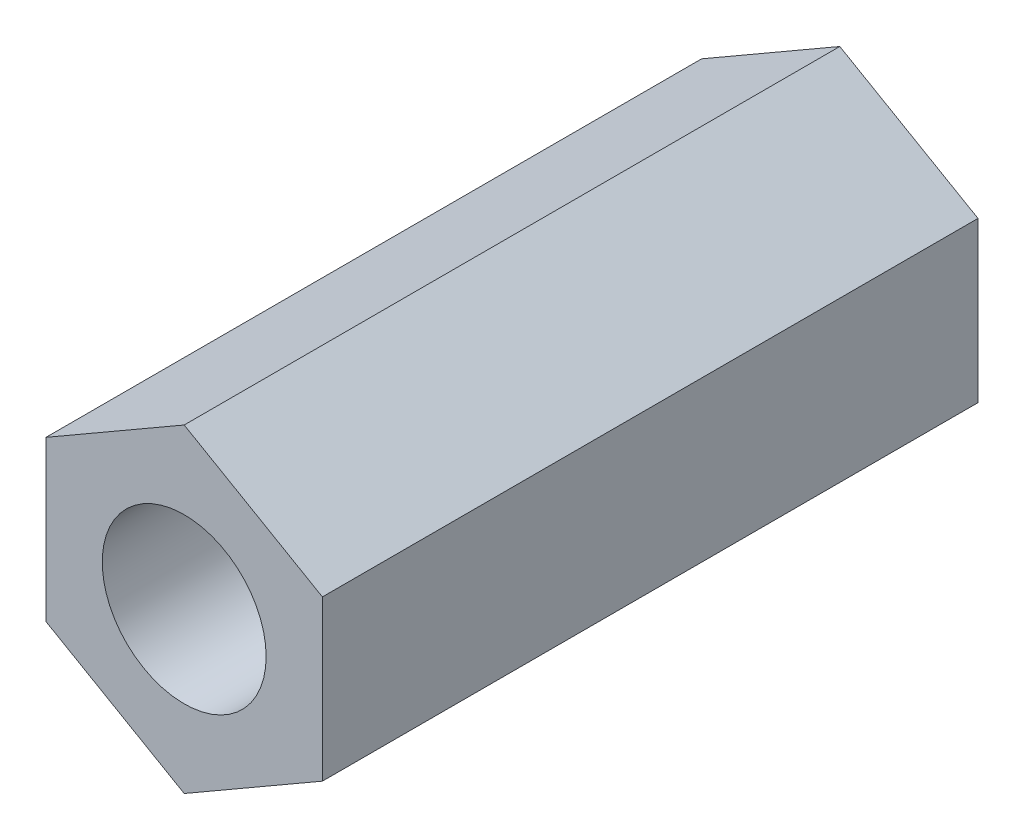
ISO-10303-21;
HEADER;
FILE_DESCRIPTION(('STEP AP214'),'2;1');
FILE_NAME('part.step','',(''),(''),'','','');
FILE_SCHEMA(('AUTOMOTIVE_DESIGN { 1 0 10303 214 1 1 1 1 }'));
ENDSEC;
DATA;
#1=APPLICATION_CONTEXT('core data for automotive mechanical design processes');
#2=APPLICATION_PROTOCOL_DEFINITION('international standard','automotive_design',2000,#1);
#3=PRODUCT_CONTEXT('',#1,'mechanical');
#4=PRODUCT('Part','Part','',(#3));
#5=PRODUCT_RELATED_PRODUCT_CATEGORY('part','',(#4));
#6=PRODUCT_DEFINITION_FORMATION('','',#4);
#7=PRODUCT_DEFINITION_CONTEXT('part definition',#1,'design');
#8=PRODUCT_DEFINITION('design','',#6,#7);
#9=PRODUCT_DEFINITION_SHAPE('','',#8);
#10=(LENGTH_UNIT() NAMED_UNIT(*) SI_UNIT(.MILLI.,.METRE.));
#11=(NAMED_UNIT(*) PLANE_ANGLE_UNIT() SI_UNIT($,.RADIAN.));
#12=(NAMED_UNIT(*) SI_UNIT($,.STERADIAN.) SOLID_ANGLE_UNIT());
#13=UNCERTAINTY_MEASURE_WITH_UNIT(LENGTH_MEASURE(1.E-05),#10,'distance_accuracy_value','');
#14=(GEOMETRIC_REPRESENTATION_CONTEXT(3) GLOBAL_UNCERTAINTY_ASSIGNED_CONTEXT((#13)) GLOBAL_UNIT_ASSIGNED_CONTEXT((#10,
#11,#12)) REPRESENTATION_CONTEXT('',''));
#15=CARTESIAN_POINT('',(0.,0.,0.));
#16=DIRECTION('',(0.,0.,1.));
#17=DIRECTION('',(1.,0.,0.));
#18=AXIS2_PLACEMENT_3D('',#15,#16,#17);
#19=CARTESIAN_POINT('',(0.,0.,11.176));
#20=DIRECTION('',(0.,0.,1.));
#21=DIRECTION('',(1.,0.,0.));
#22=AXIS2_PLACEMENT_3D('',#19,#20,#21);
#23=PLANE('',#22);
#24=DIRECTION('',(0.866025403784439,-0.499999999999999,0.));
#25=VECTOR('',#24,1.);
#26=CARTESIAN_POINT('',(-65.1574142062362,34.8983493683296,11.176));
#27=LINE('',#26,#25);
#28=CARTESIAN_POINT('',(-65.1574142062362,34.8983493683296,11.176));
#29=VERTEX_POINT('',#28);
#30=CARTESIAN_POINT('',(-62.8015642062362,33.5381987366592,11.176));
#31=VERTEX_POINT('',#30);
#32=EDGE_CURVE('E129',#29,#31,#27,.T.);
#33=ORIENTED_EDGE('',*,*,#32,.T.);
#34=DIRECTION('',(0.866025403784438,0.500000000000001,0.));
#35=VECTOR('',#34,1.);
#36=CARTESIAN_POINT('',(-62.8015642062362,33.5381987366592,11.176));
#37=LINE('',#36,#35);
#38=CARTESIAN_POINT('',(-60.4457142062362,34.8983493683296,11.176));
#39=VERTEX_POINT('',#38);
#40=EDGE_CURVE('E87',#31,#39,#37,.T.);
#41=ORIENTED_EDGE('',*,*,#40,.T.);
#42=DIRECTION('',(0.,1.,0.));
#43=VECTOR('',#42,1.);
#44=CARTESIAN_POINT('',(-60.4457142062362,34.8983493683296,11.176));
#45=LINE('',#44,#43);
#46=CARTESIAN_POINT('',(-60.4457142062362,37.6186506316703,11.176));
#47=VERTEX_POINT('',#46);
#48=EDGE_CURVE('E100',#39,#47,#45,.T.);
#49=ORIENTED_EDGE('',*,*,#48,.T.);
#50=DIRECTION('',(-0.866025403784439,0.499999999999999,0.));
#51=VECTOR('',#50,1.);
#52=CARTESIAN_POINT('',(-60.4457142062362,37.6186506316703,11.176));
#53=LINE('',#52,#51);
#54=CARTESIAN_POINT('',(-62.8015642062362,38.9788012633407,11.176));
#55=VERTEX_POINT('',#54);
#56=EDGE_CURVE('E94',#47,#55,#53,.T.);
#57=ORIENTED_EDGE('',*,*,#56,.T.);
#58=DIRECTION('',(-0.866025403784439,-0.499999999999999,0.));
#59=VECTOR('',#58,1.);
#60=CARTESIAN_POINT('',(-62.8015642062362,38.9788012633407,11.176));
#61=LINE('',#60,#59);
#62=CARTESIAN_POINT('',(-65.1574142062362,37.6186506316703,11.176));
#63=VERTEX_POINT('',#62);
#64=EDGE_CURVE('E98',#55,#63,#61,.T.);
#65=ORIENTED_EDGE('',*,*,#64,.T.);
#66=DIRECTION('',(0.,-1.,0.));
#67=VECTOR('',#66,1.);
#68=CARTESIAN_POINT('',(-65.1574142062362,37.6186506316703,11.176));
#69=LINE('',#68,#67);
#70=EDGE_CURVE('E50',#63,#29,#69,.T.);
#71=ORIENTED_EDGE('',*,*,#70,.T.);
#72=EDGE_LOOP('',(#33,#41,#49,#57,#65,#71));
#73=FACE_BOUND('',#72,.T.);
#74=CARTESIAN_POINT('',(-62.8015642062362,36.2584999999999,11.176));
#75=DIRECTION('',(0.,0.,1.));
#76=DIRECTION('',(1.,0.,0.));
#77=AXIS2_PLACEMENT_3D('',#74,#75,#76);
#78=CIRCLE('',#77,1.39700000000001);
#79=CARTESIAN_POINT('',(-61.4045642062362,36.2584999999999,11.176));
#80=VERTEX_POINT('',#79);
#81=EDGE_CURVE('E122',#80,#80,#78,.T.);
#82=ORIENTED_EDGE('',*,*,#81,.F.);
#83=EDGE_LOOP('',(#82));
#84=FACE_BOUND('',#83,.T.);
#85=ADVANCED_FACE('F33',(#73,#84),#23,.T.);
#86=CARTESIAN_POINT('',(0.,0.,0.));
#87=DIRECTION('',(0.,0.,1.));
#88=DIRECTION('',(1.,0.,0.));
#89=AXIS2_PLACEMENT_3D('',#86,#87,#88);
#90=PLANE('',#89);
#91=DIRECTION('',(0.866025403784439,-0.499999999999999,0.));
#92=VECTOR('',#91,1.);
#93=CARTESIAN_POINT('',(-65.1574142062362,34.8983493683296,0.));
#94=LINE('',#93,#92);
#95=CARTESIAN_POINT('',(-65.1574142062362,34.8983493683296,0.));
#96=VERTEX_POINT('',#95);
#97=CARTESIAN_POINT('',(-62.8015642062362,33.5381987366592,0.));
#98=VERTEX_POINT('',#97);
#99=EDGE_CURVE('E118',#96,#98,#94,.T.);
#100=ORIENTED_EDGE('',*,*,#99,.F.);
#101=DIRECTION('',(0.,-1.,0.));
#102=VECTOR('',#101,1.);
#103=CARTESIAN_POINT('',(-65.1574142062362,37.6186506316703,0.));
#104=LINE('',#103,#102);
#105=CARTESIAN_POINT('',(-65.1574142062362,37.6186506316703,0.));
#106=VERTEX_POINT('',#105);
#107=EDGE_CURVE('E79',#106,#96,#104,.T.);
#108=ORIENTED_EDGE('',*,*,#107,.F.);
#109=DIRECTION('',(-0.866025403784439,-0.499999999999999,0.));
#110=VECTOR('',#109,1.);
#111=CARTESIAN_POINT('',(-62.8015642062362,38.9788012633407,0.));
#112=LINE('',#111,#110);
#113=CARTESIAN_POINT('',(-62.8015642062362,38.9788012633407,0.));
#114=VERTEX_POINT('',#113);
#115=EDGE_CURVE('E73',#114,#106,#112,.T.);
#116=ORIENTED_EDGE('',*,*,#115,.F.);
#117=DIRECTION('',(-0.866025403784439,0.499999999999999,0.));
#118=VECTOR('',#117,1.);
#119=CARTESIAN_POINT('',(-60.4457142062362,37.6186506316703,0.));
#120=LINE('',#119,#118);
#121=CARTESIAN_POINT('',(-60.4457142062362,37.6186506316703,0.));
#122=VERTEX_POINT('',#121);
#123=EDGE_CURVE('E108',#122,#114,#120,.T.);
#124=ORIENTED_EDGE('',*,*,#123,.F.);
#125=DIRECTION('',(0.,1.,0.));
#126=VECTOR('',#125,1.);
#127=CARTESIAN_POINT('',(-60.4457142062362,34.8983493683296,0.));
#128=LINE('',#127,#126);
#129=CARTESIAN_POINT('',(-60.4457142062362,34.8983493683296,0.));
#130=VERTEX_POINT('',#129);
#131=EDGE_CURVE('E124',#130,#122,#128,.T.);
#132=ORIENTED_EDGE('',*,*,#131,.F.);
#133=DIRECTION('',(0.866025403784438,0.500000000000001,0.));
#134=VECTOR('',#133,1.);
#135=CARTESIAN_POINT('',(-62.8015642062362,33.5381987366592,0.));
#136=LINE('',#135,#134);
#137=EDGE_CURVE('E121',#98,#130,#136,.T.);
#138=ORIENTED_EDGE('',*,*,#137,.F.);
#139=EDGE_LOOP('',(#100,#108,#116,#124,#132,#138));
#140=FACE_BOUND('',#139,.T.);
#141=CARTESIAN_POINT('',(-62.8015642062362,36.2584999999999,0.));
#142=DIRECTION('',(0.,0.,1.));
#143=DIRECTION('',(1.,0.,0.));
#144=AXIS2_PLACEMENT_3D('',#141,#142,#143);
#145=CIRCLE('',#144,1.39700000000001);
#146=CARTESIAN_POINT('',(-61.4045642062362,36.2584999999999,0.));
#147=VERTEX_POINT('',#146);
#148=EDGE_CURVE('E222',#147,#147,#145,.T.);
#149=ORIENTED_EDGE('',*,*,#148,.T.);
#150=EDGE_LOOP('',(#149));
#151=FACE_BOUND('',#150,.T.);
#152=ADVANCED_FACE('F138',(#140,#151),#90,.F.);
#153=CARTESIAN_POINT('',(-65.1574142062362,34.8983493683296,11.176));
#154=DIRECTION('',(0.499999999999999,0.866025403784439,0.));
#155=DIRECTION('',(-0.866025403784439,0.499999999999999,0.));
#156=AXIS2_PLACEMENT_3D('',#153,#154,#155);
#157=PLANE('',#156);
#158=ORIENTED_EDGE('',*,*,#99,.T.);
#159=DIRECTION('',(0.,0.,-1.));
#160=VECTOR('',#159,1.);
#161=CARTESIAN_POINT('',(-62.8015642062362,33.5381987366592,11.176));
#162=LINE('',#161,#160);
#163=EDGE_CURVE('E11',#31,#98,#162,.T.);
#164=ORIENTED_EDGE('',*,*,#163,.F.);
#165=ORIENTED_EDGE('',*,*,#32,.F.);
#166=DIRECTION('',(0.,0.,-1.));
#167=VECTOR('',#166,1.);
#168=CARTESIAN_POINT('',(-65.1574142062362,34.8983493683296,11.176));
#169=LINE('',#168,#167);
#170=EDGE_CURVE('E114',#29,#96,#169,.T.);
#171=ORIENTED_EDGE('',*,*,#170,.T.);
#172=EDGE_LOOP('',(#158,#164,#165,#171));
#173=FACE_BOUND('',#172,.T.);
#174=ADVANCED_FACE('F35',(#173),#157,.F.);
#175=CARTESIAN_POINT('',(-62.8015642062362,33.5381987366592,11.176));
#176=DIRECTION('',(-0.500000000000001,0.866025403784438,0.));
#177=DIRECTION('',(-0.866025403784438,-0.500000000000001,0.));
#178=AXIS2_PLACEMENT_3D('',#175,#176,#177);
#179=PLANE('',#178);
#180=ORIENTED_EDGE('',*,*,#137,.T.);
#181=DIRECTION('',(0.,0.,-1.));
#182=VECTOR('',#181,1.);
#183=CARTESIAN_POINT('',(-60.4457142062362,34.8983493683296,11.176));
#184=LINE('',#183,#182);
#185=EDGE_CURVE('E42',#39,#130,#184,.T.);
#186=ORIENTED_EDGE('',*,*,#185,.F.);
#187=ORIENTED_EDGE('',*,*,#40,.F.);
#188=ORIENTED_EDGE('',*,*,#163,.T.);
#189=EDGE_LOOP('',(#180,#186,#187,#188));
#190=FACE_BOUND('',#189,.T.);
#191=ADVANCED_FACE('F163',(#190),#179,.F.);
#192=CARTESIAN_POINT('',(-60.4457142062362,34.8983493683296,11.176));
#193=DIRECTION('',(-1.,0.,0.));
#194=DIRECTION('',(0.,0.,1.));
#195=AXIS2_PLACEMENT_3D('',#192,#193,#194);
#196=PLANE('',#195);
#197=ORIENTED_EDGE('',*,*,#131,.T.);
#198=DIRECTION('',(0.,0.,-1.));
#199=VECTOR('',#198,1.);
#200=CARTESIAN_POINT('',(-60.4457142062362,37.6186506316703,11.176));
#201=LINE('',#200,#199);
#202=EDGE_CURVE('E109',#47,#122,#201,.T.);
#203=ORIENTED_EDGE('',*,*,#202,.F.);
#204=ORIENTED_EDGE('',*,*,#48,.F.);
#205=ORIENTED_EDGE('',*,*,#185,.T.);
#206=EDGE_LOOP('',(#197,#203,#204,#205));
#207=FACE_BOUND('',#206,.T.);
#208=ADVANCED_FACE('F135',(#207),#196,.F.);
#209=CARTESIAN_POINT('',(-60.4457142062362,37.6186506316703,11.176));
#210=DIRECTION('',(-0.499999999999999,-0.866025403784439,0.));
#211=DIRECTION('',(0.866025403784439,-0.499999999999999,0.));
#212=AXIS2_PLACEMENT_3D('',#209,#210,#211);
#213=PLANE('',#212);
#214=ORIENTED_EDGE('',*,*,#123,.T.);
#215=DIRECTION('',(0.,0.,-1.));
#216=VECTOR('',#215,1.);
#217=CARTESIAN_POINT('',(-62.8015642062362,38.9788012633407,11.176));
#218=LINE('',#217,#216);
#219=EDGE_CURVE('E105',#55,#114,#218,.T.);
#220=ORIENTED_EDGE('',*,*,#219,.F.);
#221=ORIENTED_EDGE('',*,*,#56,.F.);
#222=ORIENTED_EDGE('',*,*,#202,.T.);
#223=EDGE_LOOP('',(#214,#220,#221,#222));
#224=FACE_BOUND('',#223,.T.);
#225=ADVANCED_FACE('F106',(#224),#213,.F.);
#226=CARTESIAN_POINT('',(-62.8015642062362,38.9788012633407,11.176));
#227=DIRECTION('',(0.499999999999999,-0.866025403784439,0.));
#228=DIRECTION('',(0.866025403784439,0.499999999999999,0.));
#229=AXIS2_PLACEMENT_3D('',#226,#227,#228);
#230=PLANE('',#229);
#231=ORIENTED_EDGE('',*,*,#115,.T.);
#232=DIRECTION('',(0.,0.,-1.));
#233=VECTOR('',#232,1.);
#234=CARTESIAN_POINT('',(-65.1574142062362,37.6186506316703,11.176));
#235=LINE('',#234,#233);
#236=EDGE_CURVE('E110',#63,#106,#235,.T.);
#237=ORIENTED_EDGE('',*,*,#236,.F.);
#238=ORIENTED_EDGE('',*,*,#64,.F.);
#239=ORIENTED_EDGE('',*,*,#219,.T.);
#240=EDGE_LOOP('',(#231,#237,#238,#239));
#241=FACE_BOUND('',#240,.T.);
#242=ADVANCED_FACE('F112',(#241),#230,.F.);
#243=CARTESIAN_POINT('',(-65.1574142062362,37.6186506316703,11.176));
#244=DIRECTION('',(1.,0.,0.));
#245=DIRECTION('',(0.,0.,-1.));
#246=AXIS2_PLACEMENT_3D('',#243,#244,#245);
#247=PLANE('',#246);
#248=ORIENTED_EDGE('',*,*,#107,.T.);
#249=ORIENTED_EDGE('',*,*,#170,.F.);
#250=ORIENTED_EDGE('',*,*,#70,.F.);
#251=ORIENTED_EDGE('',*,*,#236,.T.);
#252=EDGE_LOOP('',(#248,#249,#250,#251));
#253=FACE_BOUND('',#252,.T.);
#254=ADVANCED_FACE('F143',(#253),#247,.F.);
#255=CARTESIAN_POINT('',(-62.8015642062362,36.2584999999999,11.176));
#256=DIRECTION('',(0.,0.,-1.));
#257=DIRECTION('',(-1.,0.,0.));
#258=AXIS2_PLACEMENT_3D('',#255,#256,#257);
#259=CYLINDRICAL_SURFACE('',#258,1.39700000000001);
#260=ORIENTED_EDGE('',*,*,#81,.T.);
#261=EDGE_LOOP('',(#260));
#262=FACE_BOUND('',#261,.T.);
#263=ORIENTED_EDGE('',*,*,#148,.F.);
#264=EDGE_LOOP('',(#263));
#265=FACE_BOUND('',#264,.T.);
#266=ADVANCED_FACE('F145',(#262,#265),#259,.F.);
#267=CLOSED_SHELL('',(#85,#152,#174,#191,#208,#225,#242,#254,#266));
#268=MANIFOLD_SOLID_BREP('B2',#267);
#269=ADVANCED_BREP_SHAPE_REPRESENTATION('',(#18,#268),#14);
#270=SHAPE_DEFINITION_REPRESENTATION(#9,#269);
ENDSEC;
END-ISO-10303-21;
